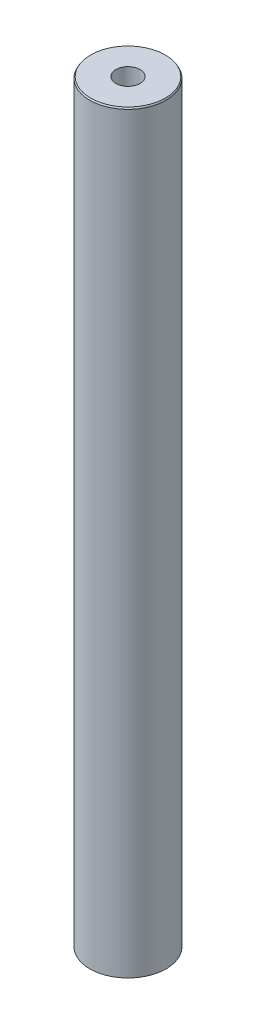
ISO-10303-21;
HEADER;
FILE_DESCRIPTION(('STEP AP214'),'2;1');
FILE_NAME('part.step','',(''),(''),'','','');
FILE_SCHEMA(('AUTOMOTIVE_DESIGN { 1 0 10303 214 1 1 1 1 }'));
ENDSEC;
DATA;
#1=APPLICATION_CONTEXT('core data for automotive mechanical design processes');
#2=APPLICATION_PROTOCOL_DEFINITION('international standard','automotive_design',2000,#1);
#3=PRODUCT_CONTEXT('',#1,'mechanical');
#4=PRODUCT('Part','Part','',(#3));
#5=PRODUCT_RELATED_PRODUCT_CATEGORY('part','',(#4));
#6=PRODUCT_DEFINITION_FORMATION('','',#4);
#7=PRODUCT_DEFINITION_CONTEXT('part definition',#1,'design');
#8=PRODUCT_DEFINITION('design','',#6,#7);
#9=PRODUCT_DEFINITION_SHAPE('','',#8);
#10=(LENGTH_UNIT() NAMED_UNIT(*) SI_UNIT(.MILLI.,.METRE.));
#11=(NAMED_UNIT(*) PLANE_ANGLE_UNIT() SI_UNIT($,.RADIAN.));
#12=(NAMED_UNIT(*) SI_UNIT($,.STERADIAN.) SOLID_ANGLE_UNIT());
#13=UNCERTAINTY_MEASURE_WITH_UNIT(LENGTH_MEASURE(1.E-05),#10,'distance_accuracy_value','');
#14=(GEOMETRIC_REPRESENTATION_CONTEXT(3) GLOBAL_UNCERTAINTY_ASSIGNED_CONTEXT((#13)) GLOBAL_UNIT_ASSIGNED_CONTEXT((#10,
#11,#12)) REPRESENTATION_CONTEXT('',''));
#15=CARTESIAN_POINT('',(0.,0.,0.));
#16=DIRECTION('',(0.,0.,1.));
#17=DIRECTION('',(1.,0.,0.));
#18=AXIS2_PLACEMENT_3D('',#15,#16,#17);
#19=CARTESIAN_POINT('',(0.,148.133478998534,0.));
#20=DIRECTION('',(0.,-1.,0.));
#21=DIRECTION('',(0.,0.,-1.));
#22=AXIS2_PLACEMENT_3D('',#19,#20,#21);
#23=CYLINDRICAL_SURFACE('',#22,7.5);
#24=CARTESIAN_POINT('',(0.,147.845827864905,0.));
#25=DIRECTION('',(0.,1.,0.));
#26=DIRECTION('',(0.,0.,1.));
#27=AXIS2_PLACEMENT_3D('',#24,#25,#26);
#28=CIRCLE('',#27,7.5);
#29=CARTESIAN_POINT('',(0.,147.845827864905,7.5));
#30=VERTEX_POINT('',#29);
#31=EDGE_CURVE('E50',#30,#30,#28,.F.);
#32=ORIENTED_EDGE('',*,*,#31,.T.);
#33=EDGE_LOOP('',(#32));
#34=FACE_BOUND('',#33,.T.);
#35=CARTESIAN_POINT('',(0.,0.166075459433368,0.));
#36=DIRECTION('',(0.,1.,0.));
#37=DIRECTION('',(0.,0.,1.));
#38=AXIS2_PLACEMENT_3D('',#35,#36,#37);
#39=CIRCLE('',#38,7.5);
#40=CARTESIAN_POINT('',(0.,0.166075459433368,7.5));
#41=VERTEX_POINT('',#40);
#42=EDGE_CURVE('E51',#41,#41,#39,.T.);
#43=ORIENTED_EDGE('',*,*,#42,.T.);
#44=EDGE_LOOP('',(#43));
#45=FACE_BOUND('',#44,.T.);
#46=ADVANCED_FACE('F39',(#34,#45),#23,.T.);
#47=CARTESIAN_POINT('',(0.,148.133478998534,0.));
#48=DIRECTION('',(0.,1.,0.));
#49=DIRECTION('',(0.,0.,1.));
#50=AXIS2_PLACEMENT_3D('',#47,#48,#49);
#51=PLANE('',#50);
#52=CARTESIAN_POINT('',(0.,148.133478998534,0.));
#53=DIRECTION('',(0.,1.,0.));
#54=DIRECTION('',(0.,0.,1.));
#55=AXIS2_PLACEMENT_3D('',#52,#53,#54);
#56=CIRCLE('',#55,7.33392454056662);
#57=CARTESIAN_POINT('',(0.,148.133478998534,7.33392454056662));
#58=VERTEX_POINT('',#57);
#59=EDGE_CURVE('E54',#58,#58,#56,.T.);
#60=ORIENTED_EDGE('',*,*,#59,.T.);
#61=EDGE_LOOP('',(#60));
#62=FACE_BOUND('',#61,.T.);
#63=CARTESIAN_POINT('',(0.,148.133478998534,0.));
#64=DIRECTION('',(0.,1.,0.));
#65=DIRECTION('',(0.,0.,1.));
#66=AXIS2_PLACEMENT_3D('',#63,#64,#65);
#67=CIRCLE('',#66,2.37771083715833);
#68=CARTESIAN_POINT('',(0.,148.133478998534,2.37771083715833));
#69=VERTEX_POINT('',#68);
#70=EDGE_CURVE('E58',#69,#69,#67,.T.);
#71=ORIENTED_EDGE('',*,*,#70,.F.);
#72=EDGE_LOOP('',(#71));
#73=FACE_BOUND('',#72,.T.);
#74=ADVANCED_FACE('F69',(#62,#73),#51,.T.);
#75=CARTESIAN_POINT('',(0.,0.,0.));
#76=DIRECTION('',(0.,1.,0.));
#77=DIRECTION('',(0.,0.,1.));
#78=AXIS2_PLACEMENT_3D('',#75,#76,#77);
#79=PLANE('',#78);
#80=CARTESIAN_POINT('',(0.,0.,0.));
#81=DIRECTION('',(0.,1.,0.));
#82=DIRECTION('',(0.,0.,1.));
#83=AXIS2_PLACEMENT_3D('',#80,#81,#82);
#84=CIRCLE('',#83,7.21234886637105);
#85=CARTESIAN_POINT('',(0.,0.,7.21234886637105));
#86=VERTEX_POINT('',#85);
#87=EDGE_CURVE('E10',#86,#86,#84,.F.);
#88=ORIENTED_EDGE('',*,*,#87,.T.);
#89=EDGE_LOOP('',(#88));
#90=FACE_BOUND('',#89,.T.);
#91=CARTESIAN_POINT('',(0.,0.,0.));
#92=DIRECTION('',(0.,1.,0.));
#93=DIRECTION('',(0.,0.,1.));
#94=AXIS2_PLACEMENT_3D('',#91,#92,#93);
#95=CIRCLE('',#94,2.37771083715833);
#96=CARTESIAN_POINT('',(0.,0.,2.37771083715833));
#97=VERTEX_POINT('',#96);
#98=EDGE_CURVE('E63',#97,#97,#95,.T.);
#99=ORIENTED_EDGE('',*,*,#98,.T.);
#100=EDGE_LOOP('',(#99));
#101=FACE_BOUND('',#100,.T.);
#102=ADVANCED_FACE('F75',(#90,#101),#79,.F.);
#103=CARTESIAN_POINT('',(0.,148.133478998534,0.));
#104=DIRECTION('',(0.,-1.,0.));
#105=DIRECTION('',(0.,0.,-1.));
#106=AXIS2_PLACEMENT_3D('',#103,#104,#105);
#107=CYLINDRICAL_SURFACE('',#106,2.37771083715833);
#108=ORIENTED_EDGE('',*,*,#70,.T.);
#109=EDGE_LOOP('',(#108));
#110=FACE_BOUND('',#109,.T.);
#111=ORIENTED_EDGE('',*,*,#98,.F.);
#112=EDGE_LOOP('',(#111));
#113=FACE_BOUND('',#112,.T.);
#114=ADVANCED_FACE('F70',(#110,#113),#107,.F.);
#115=CARTESIAN_POINT('',(0.,148.133478998534,0.));
#116=DIRECTION('',(0.,-1.,0.));
#117=DIRECTION('',(0.,0.,-1.));
#118=AXIS2_PLACEMENT_3D('',#115,#116,#117);
#119=CONICAL_SURFACE('',#118,7.33392454056662,0.523598775598311);
#120=ORIENTED_EDGE('',*,*,#31,.F.);
#121=EDGE_LOOP('',(#120));
#122=FACE_BOUND('',#121,.T.);
#123=ORIENTED_EDGE('',*,*,#59,.F.);
#124=EDGE_LOOP('',(#123));
#125=FACE_BOUND('',#124,.T.);
#126=ADVANCED_FACE('F81',(#122,#125),#119,.T.);
#127=CARTESIAN_POINT('',(0.,0.166075459433368,0.));
#128=DIRECTION('',(0.,1.,0.));
#129=DIRECTION('',(0.,0.,1.));
#130=AXIS2_PLACEMENT_3D('',#127,#128,#129);
#131=CONICAL_SURFACE('',#130,7.5,1.04719755119661);
#132=ORIENTED_EDGE('',*,*,#87,.F.);
#133=EDGE_LOOP('',(#132));
#134=FACE_BOUND('',#133,.T.);
#135=ORIENTED_EDGE('',*,*,#42,.F.);
#136=EDGE_LOOP('',(#135));
#137=FACE_BOUND('',#136,.T.);
#138=ADVANCED_FACE('F45',(#134,#137),#131,.T.);
#139=CLOSED_SHELL('',(#46,#74,#102,#114,#126,#138));
#140=MANIFOLD_SOLID_BREP('B2',#139);
#141=ADVANCED_BREP_SHAPE_REPRESENTATION('',(#18,#140),#14);
#142=SHAPE_DEFINITION_REPRESENTATION(#9,#141);
ENDSEC;
END-ISO-10303-21;
